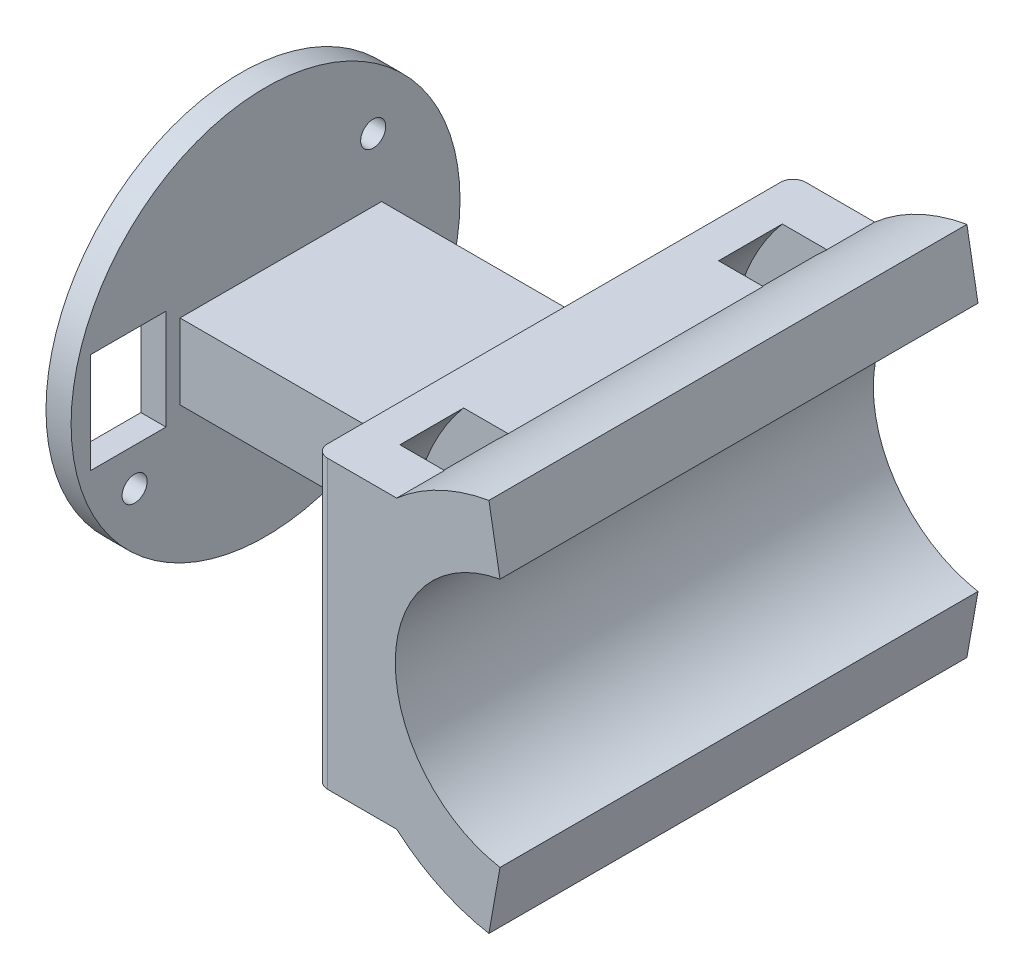
ISO-10303-21;
HEADER;
FILE_DESCRIPTION(('STEP AP214'),'2;1');
FILE_NAME('part.step','',(''),(''),'','','');
FILE_SCHEMA(('AUTOMOTIVE_DESIGN { 1 0 10303 214 1 1 1 1 }'));
ENDSEC;
DATA;
#1=APPLICATION_CONTEXT('core data for automotive mechanical design processes');
#2=APPLICATION_PROTOCOL_DEFINITION('international standard','automotive_design',2000,#1);
#3=PRODUCT_CONTEXT('',#1,'mechanical');
#4=PRODUCT('Part','Part','',(#3));
#5=PRODUCT_RELATED_PRODUCT_CATEGORY('part','',(#4));
#6=PRODUCT_DEFINITION_FORMATION('','',#4);
#7=PRODUCT_DEFINITION_CONTEXT('part definition',#1,'design');
#8=PRODUCT_DEFINITION('design','',#6,#7);
#9=PRODUCT_DEFINITION_SHAPE('','',#8);
#10=(LENGTH_UNIT() NAMED_UNIT(*) SI_UNIT(.MILLI.,.METRE.));
#11=(NAMED_UNIT(*) PLANE_ANGLE_UNIT() SI_UNIT($,.RADIAN.));
#12=(NAMED_UNIT(*) SI_UNIT($,.STERADIAN.) SOLID_ANGLE_UNIT());
#13=UNCERTAINTY_MEASURE_WITH_UNIT(LENGTH_MEASURE(1.E-05),#10,'distance_accuracy_value','');
#14=(GEOMETRIC_REPRESENTATION_CONTEXT(3) GLOBAL_UNCERTAINTY_ASSIGNED_CONTEXT((#13)) GLOBAL_UNIT_ASSIGNED_CONTEXT((#10,
#11,#12)) REPRESENTATION_CONTEXT('',''));
#15=CARTESIAN_POINT('',(0.,0.,0.));
#16=DIRECTION('',(0.,0.,1.));
#17=DIRECTION('',(1.,0.,0.));
#18=AXIS2_PLACEMENT_3D('',#15,#16,#17);
#19=CARTESIAN_POINT('',(-6.38936934946346,-11.43,19.05));
#20=DIRECTION('',(1.,0.,0.));
#21=DIRECTION('',(0.,1.,0.));
#22=AXIS2_PLACEMENT_3D('',#19,#20,#21);
#23=PLANE('',#22);
#24=DIRECTION('',(0.,0.,1.));
#25=VECTOR('',#24,1.);
#26=CARTESIAN_POINT('',(-6.38936934946345,-6.48838180573363,19.05));
#27=LINE('',#26,#25);
#28=CARTESIAN_POINT('',(-6.38936934946345,-6.48838180573363,-15.24));
#29=VERTEX_POINT('',#28);
#30=CARTESIAN_POINT('',(-6.38936934946346,-6.48838180573361,-10.16));
#31=VERTEX_POINT('',#30);
#32=EDGE_CURVE('E405',#29,#31,#27,.T.);
#33=ORIENTED_EDGE('',*,*,#32,.F.);
#34=DIRECTION('',(0.,1.,0.));
#35=VECTOR('',#34,1.);
#36=CARTESIAN_POINT('',(-6.38936934946346,-11.43,-15.24));
#37=LINE('',#36,#35);
#38=CARTESIAN_POINT('',(-6.38936934946345,6.48838180573364,-15.24));
#39=VERTEX_POINT('',#38);
#40=EDGE_CURVE('E385',#29,#39,#37,.T.);
#41=ORIENTED_EDGE('',*,*,#40,.T.);
#42=DIRECTION('',(0.,0.,1.));
#43=VECTOR('',#42,1.);
#44=CARTESIAN_POINT('',(-6.38936934946345,6.48838180573364,19.05));
#45=LINE('',#44,#43);
#46=CARTESIAN_POINT('',(-6.38936934946346,6.48838180573362,-10.16));
#47=VERTEX_POINT('',#46);
#48=EDGE_CURVE('E409',#47,#39,#45,.F.);
#49=ORIENTED_EDGE('',*,*,#48,.F.);
#50=DIRECTION('',(0.,1.,0.));
#51=VECTOR('',#50,1.);
#52=CARTESIAN_POINT('',(-6.38936934946346,-11.43,-10.16));
#53=LINE('',#52,#51);
#54=EDGE_CURVE('E374',#31,#47,#53,.T.);
#55=ORIENTED_EDGE('',*,*,#54,.F.);
#56=EDGE_LOOP('',(#33,#41,#49,#55));
#57=FACE_BOUND('',#56,.T.);
#58=DIRECTION('',(0.,-1.,0.));
#59=VECTOR('',#58,1.);
#60=CARTESIAN_POINT('',(-6.38936934946346,-3.,-9.2493893907033));
#61=LINE('',#60,#59);
#62=CARTESIAN_POINT('',(-6.38936934946346,3.,-9.2493893907033));
#63=VERTEX_POINT('',#62);
#64=CARTESIAN_POINT('',(-6.38936934946346,-3.,-9.2493893907033));
#65=VERTEX_POINT('',#64);
#66=EDGE_CURVE('E412',#63,#65,#61,.T.);
#67=ORIENTED_EDGE('',*,*,#66,.F.);
#68=DIRECTION('',(0.,0.,-1.));
#69=VECTOR('',#68,1.);
#70=CARTESIAN_POINT('',(-6.38936934946346,3.,-9.2493893907033));
#71=LINE('',#70,#69);
#72=CARTESIAN_POINT('',(-6.38936934946346,3.,6.82201027291285));
#73=VERTEX_POINT('',#72);
#74=EDGE_CURVE('E418',#73,#63,#71,.T.);
#75=ORIENTED_EDGE('',*,*,#74,.F.);
#76=DIRECTION('',(0.,1.,0.));
#77=VECTOR('',#76,1.);
#78=CARTESIAN_POINT('',(-6.38936934946346,-3.,6.82201027291285));
#79=LINE('',#78,#77);
#80=CARTESIAN_POINT('',(-6.38936934946346,-3.,6.82201027291285));
#81=VERTEX_POINT('',#80);
#82=EDGE_CURVE('E438',#81,#73,#79,.T.);
#83=ORIENTED_EDGE('',*,*,#82,.F.);
#84=DIRECTION('',(0.,0.,1.));
#85=VECTOR('',#84,1.);
#86=CARTESIAN_POINT('',(-6.38936934946346,-3.,-9.2493893907033));
#87=LINE('',#86,#85);
#88=EDGE_CURVE('E434',#65,#81,#87,.T.);
#89=ORIENTED_EDGE('',*,*,#88,.F.);
#90=EDGE_LOOP('',(#67,#75,#83,#89));
#91=FACE_BOUND('',#90,.T.);
#92=DIRECTION('',(0.,0.,-1.));
#93=VECTOR('',#92,1.);
#94=CARTESIAN_POINT('',(-6.38936934946346,11.43,19.05));
#95=LINE('',#94,#93);
#96=CARTESIAN_POINT('',(-6.38936934946346,11.43,18.05));
#97=VERTEX_POINT('',#96);
#98=CARTESIAN_POINT('',(-6.38936934946346,11.43,-18.05));
#99=VERTEX_POINT('',#98);
#100=EDGE_CURVE('E524',#97,#99,#95,.T.);
#101=ORIENTED_EDGE('',*,*,#100,.T.);
#102=DIRECTION('',(0.,-1.,0.));
#103=VECTOR('',#102,1.);
#104=CARTESIAN_POINT('',(-6.38936934946346,-11.43,-18.05));
#105=LINE('',#104,#103);
#106=CARTESIAN_POINT('',(-6.38936934946346,-11.43,-18.05));
#107=VERTEX_POINT('',#106);
#108=EDGE_CURVE('E551',#99,#107,#105,.T.);
#109=ORIENTED_EDGE('',*,*,#108,.T.);
#110=DIRECTION('',(0.,0.,-1.));
#111=VECTOR('',#110,1.);
#112=CARTESIAN_POINT('',(-6.38936934946346,-11.43,19.05));
#113=LINE('',#112,#111);
#114=CARTESIAN_POINT('',(-6.38936934946346,-11.43,18.05));
#115=VERTEX_POINT('',#114);
#116=EDGE_CURVE('E519',#115,#107,#113,.T.);
#117=ORIENTED_EDGE('',*,*,#116,.F.);
#118=DIRECTION('',(0.,-1.,0.));
#119=VECTOR('',#118,1.);
#120=CARTESIAN_POINT('',(-6.38936934946346,-11.43,18.05));
#121=LINE('',#120,#119);
#122=EDGE_CURVE('E548',#115,#97,#121,.F.);
#123=ORIENTED_EDGE('',*,*,#122,.T.);
#124=EDGE_LOOP('',(#101,#109,#117,#123));
#125=FACE_BOUND('',#124,.T.);
#126=DIRECTION('',(0.,1.,0.));
#127=VECTOR('',#126,1.);
#128=CARTESIAN_POINT('',(-6.38936934946346,-11.43,15.24));
#129=LINE('',#128,#127);
#130=CARTESIAN_POINT('',(-6.38936934946346,-6.48838180573362,15.24));
#131=VERTEX_POINT('',#130);
#132=CARTESIAN_POINT('',(-6.38936934946346,6.48838180573363,15.24));
#133=VERTEX_POINT('',#132);
#134=EDGE_CURVE('E365',#131,#133,#129,.T.);
#135=ORIENTED_EDGE('',*,*,#134,.F.);
#136=DIRECTION('',(0.,0.,1.));
#137=VECTOR('',#136,1.);
#138=CARTESIAN_POINT('',(-6.38936934946345,-6.48838180573364,19.05));
#139=LINE('',#138,#137);
#140=CARTESIAN_POINT('',(-6.38936934946346,-6.48838180573362,10.16));
#141=VERTEX_POINT('',#140);
#142=EDGE_CURVE('E393',#131,#141,#139,.F.);
#143=ORIENTED_EDGE('',*,*,#142,.T.);
#144=DIRECTION('',(0.,1.,0.));
#145=VECTOR('',#144,1.);
#146=CARTESIAN_POINT('',(-6.38936934946346,-11.43,10.16));
#147=LINE('',#146,#145);
#148=CARTESIAN_POINT('',(-6.38936934946346,6.48838180573363,10.16));
#149=VERTEX_POINT('',#148);
#150=EDGE_CURVE('E355',#141,#149,#147,.T.);
#151=ORIENTED_EDGE('',*,*,#150,.T.);
#152=DIRECTION('',(0.,0.,1.));
#153=VECTOR('',#152,1.);
#154=CARTESIAN_POINT('',(-6.38936934946345,6.48838180573365,19.05));
#155=LINE('',#154,#153);
#156=EDGE_CURVE('E397',#149,#133,#155,.T.);
#157=ORIENTED_EDGE('',*,*,#156,.T.);
#158=EDGE_LOOP('',(#135,#143,#151,#157));
#159=FACE_BOUND('',#158,.T.);
#160=ADVANCED_FACE('F47',(#57,#91,#125,#159),#23,.F.);
#161=CARTESIAN_POINT('',(0.110630650536534,11.43,19.05));
#162=DIRECTION('',(0.,-1.,0.));
#163=DIRECTION('',(1.,0.,0.));
#164=AXIS2_PLACEMENT_3D('',#161,#162,#163);
#165=PLANE('',#164);
#166=DIRECTION('',(-1.,0.,0.));
#167=VECTOR('',#166,1.);
#168=CARTESIAN_POINT('',(0.110630650536534,11.43,-19.05));
#169=LINE('',#168,#167);
#170=CARTESIAN_POINT('',(0.110630650536534,11.43,-19.05));
#171=VERTEX_POINT('',#170);
#172=CARTESIAN_POINT('',(-5.38936934946346,11.43,-19.05));
#173=VERTEX_POINT('',#172);
#174=EDGE_CURVE('E496',#171,#173,#169,.T.);
#175=ORIENTED_EDGE('',*,*,#174,.T.);
#176=CARTESIAN_POINT('',(-5.38936934946346,11.43,-18.05));
#177=DIRECTION('',(0.,-1.,0.));
#178=DIRECTION('',(1.,0.,0.));
#179=AXIS2_PLACEMENT_3D('',#176,#177,#178);
#180=CIRCLE('',#179,1.);
#181=EDGE_CURVE('E56',#173,#99,#180,.F.);
#182=ORIENTED_EDGE('',*,*,#181,.T.);
#183=ORIENTED_EDGE('',*,*,#100,.F.);
#184=CARTESIAN_POINT('',(-5.38936934946346,11.43,18.05));
#185=DIRECTION('',(0.,-1.,0.));
#186=DIRECTION('',(1.,0.,0.));
#187=AXIS2_PLACEMENT_3D('',#184,#185,#186);
#188=CIRCLE('',#187,1.);
#189=CARTESIAN_POINT('',(-5.38936934946346,11.43,19.05));
#190=VERTEX_POINT('',#189);
#191=EDGE_CURVE('E63',#97,#190,#188,.F.);
#192=ORIENTED_EDGE('',*,*,#191,.T.);
#193=DIRECTION('',(-1.,0.,0.));
#194=VECTOR('',#193,1.);
#195=CARTESIAN_POINT('',(0.110630650536534,11.43,19.05));
#196=LINE('',#195,#194);
#197=CARTESIAN_POINT('',(0.110630650536534,11.43,19.05));
#198=VERTEX_POINT('',#197);
#199=EDGE_CURVE('E472',#198,#190,#196,.T.);
#200=ORIENTED_EDGE('',*,*,#199,.F.);
#201=DIRECTION('',(0.,0.,-1.));
#202=VECTOR('',#201,1.);
#203=CARTESIAN_POINT('',(0.110630650536534,11.43,19.05));
#204=LINE('',#203,#202);
#205=CARTESIAN_POINT('',(0.110630650536528,11.43,15.24));
#206=VERTEX_POINT('',#205);
#207=EDGE_CURVE('E529',#198,#206,#204,.T.);
#208=ORIENTED_EDGE('',*,*,#207,.T.);
#209=DIRECTION('',(1.,0.,0.));
#210=VECTOR('',#209,1.);
#211=CARTESIAN_POINT('',(0.110630650536534,11.43,15.24));
#212=LINE('',#211,#210);
#213=CARTESIAN_POINT('',(-3.44080869076881,11.43,15.24));
#214=VERTEX_POINT('',#213);
#215=EDGE_CURVE('E362',#214,#206,#212,.T.);
#216=ORIENTED_EDGE('',*,*,#215,.F.);
#217=DIRECTION('',(0.,0.,1.));
#218=VECTOR('',#217,1.);
#219=CARTESIAN_POINT('',(-3.44080869076881,11.43,19.05));
#220=LINE('',#219,#218);
#221=CARTESIAN_POINT('',(-3.44080869076881,11.43,10.16));
#222=VERTEX_POINT('',#221);
#223=EDGE_CURVE('E389',#214,#222,#220,.F.);
#224=ORIENTED_EDGE('',*,*,#223,.T.);
#225=DIRECTION('',(1.,0.,0.));
#226=VECTOR('',#225,1.);
#227=CARTESIAN_POINT('',(0.110630650536534,11.43,10.16));
#228=LINE('',#227,#226);
#229=CARTESIAN_POINT('',(0.110630650536534,11.43,10.16));
#230=VERTEX_POINT('',#229);
#231=EDGE_CURVE('E351',#222,#230,#228,.T.);
#232=ORIENTED_EDGE('',*,*,#231,.T.);
#233=CARTESIAN_POINT('',(0.110630650536537,11.43,-10.16));
#234=VERTEX_POINT('',#233);
#235=EDGE_CURVE('E534',#230,#234,#204,.T.);
#236=ORIENTED_EDGE('',*,*,#235,.T.);
#237=DIRECTION('',(1.,0.,0.));
#238=VECTOR('',#237,1.);
#239=CARTESIAN_POINT('',(0.110630650536534,11.43,-10.16));
#240=LINE('',#239,#238);
#241=CARTESIAN_POINT('',(-3.44080869076881,11.43,-10.16));
#242=VERTEX_POINT('',#241);
#243=EDGE_CURVE('E371',#242,#234,#240,.T.);
#244=ORIENTED_EDGE('',*,*,#243,.F.);
#245=DIRECTION('',(0.,0.,1.));
#246=VECTOR('',#245,1.);
#247=CARTESIAN_POINT('',(-3.44080869076881,11.43,19.05));
#248=LINE('',#247,#246);
#249=CARTESIAN_POINT('',(-3.44080869076881,11.43,-15.24));
#250=VERTEX_POINT('',#249);
#251=EDGE_CURVE('E401',#250,#242,#248,.T.);
#252=ORIENTED_EDGE('',*,*,#251,.F.);
#253=DIRECTION('',(1.,0.,0.));
#254=VECTOR('',#253,1.);
#255=CARTESIAN_POINT('',(0.110630650536534,11.43,-15.24));
#256=LINE('',#255,#254);
#257=CARTESIAN_POINT('',(0.110630650536533,11.43,-15.24));
#258=VERTEX_POINT('',#257);
#259=EDGE_CURVE('E381',#250,#258,#256,.T.);
#260=ORIENTED_EDGE('',*,*,#259,.T.);
#261=EDGE_CURVE('E528',#258,#171,#204,.T.);
#262=ORIENTED_EDGE('',*,*,#261,.T.);
#263=EDGE_LOOP('',(#175,#182,#183,#192,#200,#208,#216,#224,#232,#236,#244,#252,#260,#262));
#264=FACE_BOUND('',#263,.T.);
#265=ADVANCED_FACE('F566',(#264),#165,.F.);
#266=CARTESIAN_POINT('',(0.110630650536537,-11.43,19.05));
#267=DIRECTION('',(0.,1.,0.));
#268=DIRECTION('',(-1.,0.,0.));
#269=AXIS2_PLACEMENT_3D('',#266,#267,#268);
#270=PLANE('',#269);
#271=ORIENTED_EDGE('',*,*,#116,.T.);
#272=CARTESIAN_POINT('',(-5.38936934946346,-11.43,-18.05));
#273=DIRECTION('',(0.,1.,0.));
#274=DIRECTION('',(-1.,0.,0.));
#275=AXIS2_PLACEMENT_3D('',#272,#273,#274);
#276=CIRCLE('',#275,1.);
#277=CARTESIAN_POINT('',(-5.38936934946346,-11.43,-19.05));
#278=VERTEX_POINT('',#277);
#279=EDGE_CURVE('E558',#107,#278,#276,.F.);
#280=ORIENTED_EDGE('',*,*,#279,.T.);
#281=DIRECTION('',(1.,0.,0.));
#282=VECTOR('',#281,1.);
#283=CARTESIAN_POINT('',(0.110630650536537,-11.43,-19.05));
#284=LINE('',#283,#282);
#285=CARTESIAN_POINT('',(0.11063065053654,-11.43,-19.05));
#286=VERTEX_POINT('',#285);
#287=EDGE_CURVE('E499',#278,#286,#284,.T.);
#288=ORIENTED_EDGE('',*,*,#287,.T.);
#289=DIRECTION('',(0.,0.,-1.));
#290=VECTOR('',#289,1.);
#291=CARTESIAN_POINT('',(0.11063065053654,-11.43,19.05));
#292=LINE('',#291,#290);
#293=CARTESIAN_POINT('',(0.110630650536542,-11.43,-15.24));
#294=VERTEX_POINT('',#293);
#295=EDGE_CURVE('E514',#294,#286,#292,.T.);
#296=ORIENTED_EDGE('',*,*,#295,.F.);
#297=DIRECTION('',(-1.,0.,0.));
#298=VECTOR('',#297,1.);
#299=CARTESIAN_POINT('',(0.110630650536537,-11.43,-15.24));
#300=LINE('',#299,#298);
#301=CARTESIAN_POINT('',(-3.4408086907688,-11.43,-15.24));
#302=VERTEX_POINT('',#301);
#303=EDGE_CURVE('E377',#294,#302,#300,.T.);
#304=ORIENTED_EDGE('',*,*,#303,.T.);
#305=DIRECTION('',(0.,0.,1.));
#306=VECTOR('',#305,1.);
#307=CARTESIAN_POINT('',(-3.4408086907688,-11.43,19.05));
#308=LINE('',#307,#306);
#309=CARTESIAN_POINT('',(-3.4408086907688,-11.43,-10.16));
#310=VERTEX_POINT('',#309);
#311=EDGE_CURVE('E545',#310,#302,#308,.F.);
#312=ORIENTED_EDGE('',*,*,#311,.F.);
#313=DIRECTION('',(-1.,0.,0.));
#314=VECTOR('',#313,1.);
#315=CARTESIAN_POINT('',(0.110630650536537,-11.43,-10.16));
#316=LINE('',#315,#314);
#317=CARTESIAN_POINT('',(0.11063065053654,-11.43,-10.16));
#318=VERTEX_POINT('',#317);
#319=EDGE_CURVE('E368',#318,#310,#316,.T.);
#320=ORIENTED_EDGE('',*,*,#319,.F.);
#321=CARTESIAN_POINT('',(0.11063065053654,-11.43,10.16));
#322=VERTEX_POINT('',#321);
#323=EDGE_CURVE('E520',#322,#318,#292,.T.);
#324=ORIENTED_EDGE('',*,*,#323,.F.);
#325=DIRECTION('',(-1.,0.,0.));
#326=VECTOR('',#325,1.);
#327=CARTESIAN_POINT('',(0.110630650536537,-11.43,10.16));
#328=LINE('',#327,#326);
#329=CARTESIAN_POINT('',(-3.44080869076881,-11.43,10.16));
#330=VERTEX_POINT('',#329);
#331=EDGE_CURVE('E333',#322,#330,#328,.T.);
#332=ORIENTED_EDGE('',*,*,#331,.T.);
#333=DIRECTION('',(0.,0.,1.));
#334=VECTOR('',#333,1.);
#335=CARTESIAN_POINT('',(-3.44080869076881,-11.43,19.05));
#336=LINE('',#335,#334);
#337=CARTESIAN_POINT('',(-3.44080869076881,-11.43,15.24));
#338=VERTEX_POINT('',#337);
#339=EDGE_CURVE('E541',#330,#338,#336,.T.);
#340=ORIENTED_EDGE('',*,*,#339,.T.);
#341=DIRECTION('',(-1.,0.,0.));
#342=VECTOR('',#341,1.);
#343=CARTESIAN_POINT('',(0.110630650536537,-11.43,15.24));
#344=LINE('',#343,#342);
#345=CARTESIAN_POINT('',(0.11063065053654,-11.43,15.24));
#346=VERTEX_POINT('',#345);
#347=EDGE_CURVE('E359',#346,#338,#344,.T.);
#348=ORIENTED_EDGE('',*,*,#347,.F.);
#349=CARTESIAN_POINT('',(0.11063065053654,-11.43,19.05));
#350=VERTEX_POINT('',#349);
#351=EDGE_CURVE('E515',#350,#346,#292,.T.);
#352=ORIENTED_EDGE('',*,*,#351,.F.);
#353=DIRECTION('',(1.,0.,0.));
#354=VECTOR('',#353,1.);
#355=CARTESIAN_POINT('',(0.110630650536537,-11.43,19.05));
#356=LINE('',#355,#354);
#357=CARTESIAN_POINT('',(-5.38936934946346,-11.43,19.05));
#358=VERTEX_POINT('',#357);
#359=EDGE_CURVE('E475',#358,#350,#356,.T.);
#360=ORIENTED_EDGE('',*,*,#359,.F.);
#361=CARTESIAN_POINT('',(-5.38936934946346,-11.43,18.05));
#362=DIRECTION('',(0.,1.,0.));
#363=DIRECTION('',(-1.,0.,0.));
#364=AXIS2_PLACEMENT_3D('',#361,#362,#363);
#365=CIRCLE('',#364,1.);
#366=EDGE_CURVE('E555',#358,#115,#365,.F.);
#367=ORIENTED_EDGE('',*,*,#366,.T.);
#368=EDGE_LOOP('',(#271,#280,#288,#296,#304,#312,#320,#324,#332,#340,#348,#352,#360,#367));
#369=FACE_BOUND('',#368,.T.);
#370=ADVANCED_FACE('F575',(#369),#270,.F.);
#371=CARTESIAN_POINT('',(10.1,0.,19.05));
#372=DIRECTION('',(0.,0.,-1.));
#373=DIRECTION('',(-1.,0.,0.));
#374=AXIS2_PLACEMENT_3D('',#371,#372,#373);
#375=CYLINDRICAL_SURFACE('',#374,10.1);
#376=CARTESIAN_POINT('',(10.1,0.,-19.05));
#377=DIRECTION('',(0.,0.,-1.));
#378=DIRECTION('',(-1.,0.,0.));
#379=AXIS2_PLACEMENT_3D('',#376,#377,#378);
#380=CIRCLE('',#379,10.1);
#381=CARTESIAN_POINT('',(8.34615340556399,-9.9465583054233,-19.05));
#382=VERTEX_POINT('',#381);
#383=CARTESIAN_POINT('',(8.34615340556399,9.9465583054233,-19.05));
#384=VERTEX_POINT('',#383);
#385=EDGE_CURVE('E460',#382,#384,#380,.T.);
#386=ORIENTED_EDGE('',*,*,#385,.T.);
#387=DIRECTION('',(0.,0.,-1.));
#388=VECTOR('',#387,1.);
#389=CARTESIAN_POINT('',(8.34615340556399,9.9465583054233,19.05));
#390=LINE('',#389,#388);
#391=CARTESIAN_POINT('',(8.34615340556399,9.9465583054233,19.05));
#392=VERTEX_POINT('',#391);
#393=EDGE_CURVE('E537',#392,#384,#390,.T.);
#394=ORIENTED_EDGE('',*,*,#393,.F.);
#395=CARTESIAN_POINT('',(10.1,0.,19.05));
#396=DIRECTION('',(0.,0.,-1.));
#397=DIRECTION('',(-1.,0.,0.));
#398=AXIS2_PLACEMENT_3D('',#395,#396,#397);
#399=CIRCLE('',#398,10.1);
#400=CARTESIAN_POINT('',(8.34615340556399,-9.9465583054233,19.05));
#401=VERTEX_POINT('',#400);
#402=EDGE_CURVE('E461',#401,#392,#399,.T.);
#403=ORIENTED_EDGE('',*,*,#402,.F.);
#404=DIRECTION('',(0.,0.,-1.));
#405=VECTOR('',#404,1.);
#406=CARTESIAN_POINT('',(8.34615340556399,-9.9465583054233,19.05));
#407=LINE('',#406,#405);
#408=EDGE_CURVE('E484',#401,#382,#407,.T.);
#409=ORIENTED_EDGE('',*,*,#408,.T.);
#410=EDGE_LOOP('',(#386,#394,#403,#409));
#411=FACE_BOUND('',#410,.T.);
#412=ADVANCED_FACE('F650',(#411),#375,.F.);
#413=CARTESIAN_POINT('',(8.34615340556399,9.9465583054233,19.05));
#414=DIRECTION('',(-0.984807753012208,-0.173648177666931,0.));
#415=DIRECTION('',(0.173648177666931,-0.984807753012208,0.));
#416=AXIS2_PLACEMENT_3D('',#413,#414,#415);
#417=PLANE('',#416);
#418=DIRECTION('',(-0.173648177666931,0.984807753012208,0.));
#419=VECTOR('',#418,1.);
#420=CARTESIAN_POINT('',(8.34615340556399,9.9465583054233,-19.05));
#421=LINE('',#420,#419);
#422=CARTESIAN_POINT('',(7.46402066301598,14.9493816907253,-19.05));
#423=VERTEX_POINT('',#422);
#424=EDGE_CURVE('E488',#384,#423,#421,.T.);
#425=ORIENTED_EDGE('',*,*,#424,.T.);
#426=DIRECTION('',(0.,0.,-1.));
#427=VECTOR('',#426,1.);
#428=CARTESIAN_POINT('',(7.46402066301598,14.9493816907253,19.05));
#429=LINE('',#428,#427);
#430=CARTESIAN_POINT('',(7.46402066301598,14.9493816907253,19.05));
#431=VERTEX_POINT('',#430);
#432=EDGE_CURVE('E533',#431,#423,#429,.T.);
#433=ORIENTED_EDGE('',*,*,#432,.F.);
#434=DIRECTION('',(-0.173648177666931,0.984807753012208,0.));
#435=VECTOR('',#434,1.);
#436=CARTESIAN_POINT('',(8.34615340556399,9.9465583054233,19.05));
#437=LINE('',#436,#435);
#438=EDGE_CURVE('E465',#392,#431,#437,.T.);
#439=ORIENTED_EDGE('',*,*,#438,.F.);
#440=ORIENTED_EDGE('',*,*,#393,.T.);
#441=EDGE_LOOP('',(#425,#433,#439,#440));
#442=FACE_BOUND('',#441,.T.);
#443=ADVANCED_FACE('F647',(#442),#417,.F.);
#444=CARTESIAN_POINT('',(10.1,0.,19.05));
#445=DIRECTION('',(0.,0.,-1.));
#446=DIRECTION('',(-1.,0.,0.));
#447=AXIS2_PLACEMENT_3D('',#444,#445,#446);
#448=CYLINDRICAL_SURFACE('',#447,15.18);
#449=ORIENTED_EDGE('',*,*,#432,.T.);
#450=CARTESIAN_POINT('',(10.1,0.,-19.05));
#451=DIRECTION('',(0.,0.,1.));
#452=DIRECTION('',(-1.,0.,0.));
#453=AXIS2_PLACEMENT_3D('',#450,#451,#452);
#454=CIRCLE('',#453,15.18);
#455=EDGE_CURVE('E492',#423,#171,#454,.T.);
#456=ORIENTED_EDGE('',*,*,#455,.T.);
#457=ORIENTED_EDGE('',*,*,#261,.F.);
#458=CARTESIAN_POINT('',(10.1,0.,-15.24));
#459=DIRECTION('',(0.,0.,1.));
#460=DIRECTION('',(1.,0.,0.));
#461=AXIS2_PLACEMENT_3D('',#458,#459,#460);
#462=CIRCLE('',#461,15.18);
#463=EDGE_CURVE('E329',#258,#294,#462,.T.);
#464=ORIENTED_EDGE('',*,*,#463,.T.);
#465=ORIENTED_EDGE('',*,*,#295,.T.);
#466=CARTESIAN_POINT('',(10.1,0.,-19.05));
#467=DIRECTION('',(0.,0.,1.));
#468=DIRECTION('',(-1.,0.,0.));
#469=AXIS2_PLACEMENT_3D('',#466,#467,#468);
#470=CIRCLE('',#469,15.18);
#471=CARTESIAN_POINT('',(7.46402066301598,-14.9493816907253,-19.05));
#472=VERTEX_POINT('',#471);
#473=EDGE_CURVE('E502',#286,#472,#470,.T.);
#474=ORIENTED_EDGE('',*,*,#473,.T.);
#475=DIRECTION('',(0.,0.,-1.));
#476=VECTOR('',#475,1.);
#477=CARTESIAN_POINT('',(7.46402066301598,-14.9493816907253,19.05));
#478=LINE('',#477,#476);
#479=CARTESIAN_POINT('',(7.46402066301598,-14.9493816907253,19.05));
#480=VERTEX_POINT('',#479);
#481=EDGE_CURVE('E511',#480,#472,#478,.T.);
#482=ORIENTED_EDGE('',*,*,#481,.F.);
#483=CARTESIAN_POINT('',(10.1,0.,19.05));
#484=DIRECTION('',(0.,0.,1.));
#485=DIRECTION('',(-1.,0.,0.));
#486=AXIS2_PLACEMENT_3D('',#483,#484,#485);
#487=CIRCLE('',#486,15.18);
#488=EDGE_CURVE('E478',#350,#480,#487,.T.);
#489=ORIENTED_EDGE('',*,*,#488,.F.);
#490=ORIENTED_EDGE('',*,*,#351,.T.);
#491=CARTESIAN_POINT('',(10.1,0.,15.24));
#492=DIRECTION('',(0.,0.,1.));
#493=DIRECTION('',(1.,0.,0.));
#494=AXIS2_PLACEMENT_3D('',#491,#492,#493);
#495=CIRCLE('',#494,15.18);
#496=EDGE_CURVE('E341',#206,#346,#495,.T.);
#497=ORIENTED_EDGE('',*,*,#496,.F.);
#498=ORIENTED_EDGE('',*,*,#207,.F.);
#499=CARTESIAN_POINT('',(10.1,0.,19.05));
#500=DIRECTION('',(0.,0.,1.));
#501=DIRECTION('',(-1.,0.,0.));
#502=AXIS2_PLACEMENT_3D('',#499,#500,#501);
#503=CIRCLE('',#502,15.18);
#504=EDGE_CURVE('E469',#431,#198,#503,.T.);
#505=ORIENTED_EDGE('',*,*,#504,.F.);
#506=EDGE_LOOP('',(#449,#456,#457,#464,#465,#474,#482,#489,#490,#497,#498,#505));
#507=FACE_BOUND('',#506,.T.);
#508=CARTESIAN_POINT('',(10.1,0.,-10.16));
#509=DIRECTION('',(0.,0.,1.));
#510=DIRECTION('',(1.,0.,0.));
#511=AXIS2_PLACEMENT_3D('',#508,#509,#510);
#512=CIRCLE('',#511,15.18);
#513=EDGE_CURVE('E315',#234,#318,#512,.T.);
#514=ORIENTED_EDGE('',*,*,#513,.F.);
#515=ORIENTED_EDGE('',*,*,#235,.F.);
#516=CARTESIAN_POINT('',(10.1,0.,10.16));
#517=DIRECTION('',(0.,0.,1.));
#518=DIRECTION('',(1.,0.,0.));
#519=AXIS2_PLACEMENT_3D('',#516,#517,#518);
#520=CIRCLE('',#519,15.18);
#521=EDGE_CURVE('E337',#230,#322,#520,.T.);
#522=ORIENTED_EDGE('',*,*,#521,.T.);
#523=ORIENTED_EDGE('',*,*,#323,.T.);
#524=EDGE_LOOP('',(#514,#515,#522,#523));
#525=FACE_BOUND('',#524,.T.);
#526=ADVANCED_FACE('F584',(#507,#525),#448,.T.);
#527=CARTESIAN_POINT('',(8.34615340556399,-9.9465583054233,19.05));
#528=DIRECTION('',(-0.984807753012208,0.173648177666931,0.));
#529=DIRECTION('',(-0.173648177666931,-0.984807753012208,0.));
#530=AXIS2_PLACEMENT_3D('',#527,#528,#529);
#531=PLANE('',#530);
#532=DIRECTION('',(0.173648177666931,0.984807753012208,0.));
#533=VECTOR('',#532,1.);
#534=CARTESIAN_POINT('',(8.34615340556399,-9.9465583054233,-19.05));
#535=LINE('',#534,#533);
#536=EDGE_CURVE('E466',#472,#382,#535,.T.);
#537=ORIENTED_EDGE('',*,*,#536,.T.);
#538=ORIENTED_EDGE('',*,*,#408,.F.);
#539=DIRECTION('',(0.173648177666931,0.984807753012208,0.));
#540=VECTOR('',#539,1.);
#541=CARTESIAN_POINT('',(8.34615340556399,-9.9465583054233,19.05));
#542=LINE('',#541,#540);
#543=EDGE_CURVE('E481',#480,#401,#542,.T.);
#544=ORIENTED_EDGE('',*,*,#543,.F.);
#545=ORIENTED_EDGE('',*,*,#481,.T.);
#546=EDGE_LOOP('',(#537,#538,#544,#545));
#547=FACE_BOUND('',#546,.T.);
#548=ADVANCED_FACE('F714',(#547),#531,.F.);
#549=CARTESIAN_POINT('',(10.1,0.,19.05));
#550=DIRECTION('',(0.,0.,-1.));
#551=DIRECTION('',(-1.,0.,0.));
#552=AXIS2_PLACEMENT_3D('',#549,#550,#551);
#553=PLANE('',#552);
#554=ORIENTED_EDGE('',*,*,#199,.T.);
#555=DIRECTION('',(0.,-1.,0.));
#556=VECTOR('',#555,1.);
#557=CARTESIAN_POINT('',(-5.38936934946346,0.,19.05));
#558=LINE('',#557,#556);
#559=EDGE_CURVE('E11',#190,#358,#558,.T.);
#560=ORIENTED_EDGE('',*,*,#559,.T.);
#561=ORIENTED_EDGE('',*,*,#359,.T.);
#562=ORIENTED_EDGE('',*,*,#488,.T.);
#563=ORIENTED_EDGE('',*,*,#543,.T.);
#564=ORIENTED_EDGE('',*,*,#402,.T.);
#565=ORIENTED_EDGE('',*,*,#438,.T.);
#566=ORIENTED_EDGE('',*,*,#504,.T.);
#567=EDGE_LOOP('',(#554,#560,#561,#562,#563,#564,#565,#566));
#568=FACE_BOUND('',#567,.T.);
#569=ADVANCED_FACE('F626',(#568),#553,.F.);
#570=CARTESIAN_POINT('',(10.1,0.,-19.05));
#571=DIRECTION('',(0.,0.,-1.));
#572=DIRECTION('',(-1.,0.,0.));
#573=AXIS2_PLACEMENT_3D('',#570,#571,#572);
#574=PLANE('',#573);
#575=ORIENTED_EDGE('',*,*,#287,.F.);
#576=DIRECTION('',(0.,-1.,0.));
#577=VECTOR('',#576,1.);
#578=CARTESIAN_POINT('',(-5.38936934946346,11.43,-19.05));
#579=LINE('',#578,#577);
#580=EDGE_CURVE('E71',#278,#173,#579,.F.);
#581=ORIENTED_EDGE('',*,*,#580,.T.);
#582=ORIENTED_EDGE('',*,*,#174,.F.);
#583=ORIENTED_EDGE('',*,*,#455,.F.);
#584=ORIENTED_EDGE('',*,*,#424,.F.);
#585=ORIENTED_EDGE('',*,*,#385,.F.);
#586=ORIENTED_EDGE('',*,*,#536,.F.);
#587=ORIENTED_EDGE('',*,*,#473,.F.);
#588=EDGE_LOOP('',(#575,#581,#582,#583,#584,#585,#586,#587));
#589=FACE_BOUND('',#588,.T.);
#590=ADVANCED_FACE('F579',(#589),#574,.T.);
#591=CARTESIAN_POINT('',(-29.3893693494635,-3.,-9.2493893907033));
#592=DIRECTION('',(0.,0.,1.));
#593=DIRECTION('',(1.,0.,0.));
#594=AXIS2_PLACEMENT_3D('',#591,#592,#593);
#595=PLANE('',#594);
#596=ORIENTED_EDGE('',*,*,#66,.T.);
#597=DIRECTION('',(1.,0.,0.));
#598=VECTOR('',#597,1.);
#599=CARTESIAN_POINT('',(-29.3893693494635,-3.,-9.2493893907033));
#600=LINE('',#599,#598);
#601=CARTESIAN_POINT('',(-29.3893693494635,-3.,-9.2493893907033));
#602=VERTEX_POINT('',#601);
#603=EDGE_CURVE('E456',#602,#65,#600,.T.);
#604=ORIENTED_EDGE('',*,*,#603,.F.);
#605=DIRECTION('',(0.,-1.,0.));
#606=VECTOR('',#605,1.);
#607=CARTESIAN_POINT('',(-29.3893693494635,-3.,-9.2493893907033));
#608=LINE('',#607,#606);
#609=CARTESIAN_POINT('',(-29.3893693494635,3.,-9.2493893907033));
#610=VERTEX_POINT('',#609);
#611=EDGE_CURVE('E413',#610,#602,#608,.T.);
#612=ORIENTED_EDGE('',*,*,#611,.F.);
#613=DIRECTION('',(1.,0.,0.));
#614=VECTOR('',#613,1.);
#615=CARTESIAN_POINT('',(-29.3893693494635,3.,-9.2493893907033));
#616=LINE('',#615,#614);
#617=EDGE_CURVE('E430',#610,#63,#616,.T.);
#618=ORIENTED_EDGE('',*,*,#617,.T.);
#619=EDGE_LOOP('',(#596,#604,#612,#618));
#620=FACE_BOUND('',#619,.T.);
#621=ADVANCED_FACE('F707',(#620),#595,.F.);
#622=CARTESIAN_POINT('',(-29.3893693494635,-3.,-9.2493893907033));
#623=DIRECTION('',(0.,1.,0.));
#624=DIRECTION('',(0.,0.,1.));
#625=AXIS2_PLACEMENT_3D('',#622,#623,#624);
#626=PLANE('',#625);
#627=ORIENTED_EDGE('',*,*,#88,.T.);
#628=DIRECTION('',(1.,0.,0.));
#629=VECTOR('',#628,1.);
#630=CARTESIAN_POINT('',(-29.3893693494635,-3.,6.82201027291285));
#631=LINE('',#630,#629);
#632=CARTESIAN_POINT('',(-29.3893693494635,-3.,6.82201027291285));
#633=VERTEX_POINT('',#632);
#634=EDGE_CURVE('E452',#633,#81,#631,.T.);
#635=ORIENTED_EDGE('',*,*,#634,.F.);
#636=DIRECTION('',(0.,0.,1.));
#637=VECTOR('',#636,1.);
#638=CARTESIAN_POINT('',(-29.3893693494635,-3.,-9.2493893907033));
#639=LINE('',#638,#637);
#640=EDGE_CURVE('E417',#602,#633,#639,.T.);
#641=ORIENTED_EDGE('',*,*,#640,.F.);
#642=ORIENTED_EDGE('',*,*,#603,.T.);
#643=EDGE_LOOP('',(#627,#635,#641,#642));
#644=FACE_BOUND('',#643,.T.);
#645=ADVANCED_FACE('F703',(#644),#626,.F.);
#646=CARTESIAN_POINT('',(-29.3893693494635,-3.,6.82201027291285));
#647=DIRECTION('',(0.,0.,-1.));
#648=DIRECTION('',(-1.,0.,0.));
#649=AXIS2_PLACEMENT_3D('',#646,#647,#648);
#650=PLANE('',#649);
#651=ORIENTED_EDGE('',*,*,#82,.T.);
#652=DIRECTION('',(1.,0.,0.));
#653=VECTOR('',#652,1.);
#654=CARTESIAN_POINT('',(-29.3893693494635,3.,6.82201027291285));
#655=LINE('',#654,#653);
#656=CARTESIAN_POINT('',(-29.3893693494635,3.,6.82201027291285));
#657=VERTEX_POINT('',#656);
#658=EDGE_CURVE('E448',#657,#73,#655,.T.);
#659=ORIENTED_EDGE('',*,*,#658,.F.);
#660=DIRECTION('',(0.,1.,0.));
#661=VECTOR('',#660,1.);
#662=CARTESIAN_POINT('',(-29.3893693494635,-3.,6.82201027291285));
#663=LINE('',#662,#661);
#664=EDGE_CURVE('E422',#633,#657,#663,.T.);
#665=ORIENTED_EDGE('',*,*,#664,.F.);
#666=ORIENTED_EDGE('',*,*,#634,.T.);
#667=EDGE_LOOP('',(#651,#659,#665,#666));
#668=FACE_BOUND('',#667,.T.);
#669=ADVANCED_FACE('F699',(#668),#650,.F.);
#670=CARTESIAN_POINT('',(-29.3893693494635,3.,-9.2493893907033));
#671=DIRECTION('',(0.,-1.,0.));
#672=DIRECTION('',(0.,0.,-1.));
#673=AXIS2_PLACEMENT_3D('',#670,#671,#672);
#674=PLANE('',#673);
#675=ORIENTED_EDGE('',*,*,#74,.T.);
#676=ORIENTED_EDGE('',*,*,#617,.F.);
#677=DIRECTION('',(0.,0.,-1.));
#678=VECTOR('',#677,1.);
#679=CARTESIAN_POINT('',(-29.3893693494635,3.,-9.2493893907033));
#680=LINE('',#679,#678);
#681=EDGE_CURVE('E426',#657,#610,#680,.T.);
#682=ORIENTED_EDGE('',*,*,#681,.F.);
#683=ORIENTED_EDGE('',*,*,#658,.T.);
#684=EDGE_LOOP('',(#675,#676,#682,#683));
#685=FACE_BOUND('',#684,.T.);
#686=ADVANCED_FACE('F696',(#685),#674,.F.);
#687=CARTESIAN_POINT('',(10.1,0.,19.05));
#688=DIRECTION('',(0.,0.,1.));
#689=DIRECTION('',(1.,0.,0.));
#690=AXIS2_PLACEMENT_3D('',#687,#688,#689);
#691=CYLINDRICAL_SURFACE('',#690,17.72);
#692=CARTESIAN_POINT('',(10.1,0.,10.16));
#693=DIRECTION('',(0.,0.,1.));
#694=DIRECTION('',(1.,0.,0.));
#695=AXIS2_PLACEMENT_3D('',#692,#693,#694);
#696=CIRCLE('',#695,17.72);
#697=EDGE_CURVE('E334',#222,#149,#696,.T.);
#698=ORIENTED_EDGE('',*,*,#697,.F.);
#699=ORIENTED_EDGE('',*,*,#223,.F.);
#700=CARTESIAN_POINT('',(10.1,0.,15.24));
#701=DIRECTION('',(0.,0.,1.));
#702=DIRECTION('',(1.,0.,0.));
#703=AXIS2_PLACEMENT_3D('',#700,#701,#702);
#704=CIRCLE('',#703,17.72);
#705=EDGE_CURVE('E319',#214,#133,#704,.T.);
#706=ORIENTED_EDGE('',*,*,#705,.T.);
#707=ORIENTED_EDGE('',*,*,#156,.F.);
#708=EDGE_LOOP('',(#698,#699,#706,#707));
#709=FACE_BOUND('',#708,.T.);
#710=ADVANCED_FACE('F669',(#709),#691,.F.);
#711=EDGE_CURVE('E344',#131,#338,#704,.T.);
#712=ORIENTED_EDGE('',*,*,#711,.T.);
#713=ORIENTED_EDGE('',*,*,#339,.F.);
#714=EDGE_CURVE('E311',#141,#330,#696,.T.);
#715=ORIENTED_EDGE('',*,*,#714,.F.);
#716=ORIENTED_EDGE('',*,*,#142,.F.);
#717=EDGE_LOOP('',(#712,#713,#715,#716));
#718=FACE_BOUND('',#717,.T.);
#719=ADVANCED_FACE('F617',(#718),#691,.F.);
#720=CARTESIAN_POINT('',(0.,0.,15.24));
#721=DIRECTION('',(0.,0.,-1.));
#722=DIRECTION('',(-1.,0.,0.));
#723=AXIS2_PLACEMENT_3D('',#720,#721,#722);
#724=PLANE('',#723);
#725=ORIENTED_EDGE('',*,*,#134,.T.);
#726=ORIENTED_EDGE('',*,*,#705,.F.);
#727=ORIENTED_EDGE('',*,*,#215,.T.);
#728=ORIENTED_EDGE('',*,*,#496,.T.);
#729=ORIENTED_EDGE('',*,*,#347,.T.);
#730=ORIENTED_EDGE('',*,*,#711,.F.);
#731=EDGE_LOOP('',(#725,#726,#727,#728,#729,#730));
#732=FACE_BOUND('',#731,.T.);
#733=ADVANCED_FACE('F664',(#732),#724,.T.);
#734=CARTESIAN_POINT('',(0.,0.,10.16));
#735=DIRECTION('',(0.,0.,-1.));
#736=DIRECTION('',(-1.,0.,0.));
#737=AXIS2_PLACEMENT_3D('',#734,#735,#736);
#738=PLANE('',#737);
#739=ORIENTED_EDGE('',*,*,#714,.T.);
#740=ORIENTED_EDGE('',*,*,#331,.F.);
#741=ORIENTED_EDGE('',*,*,#521,.F.);
#742=ORIENTED_EDGE('',*,*,#231,.F.);
#743=ORIENTED_EDGE('',*,*,#697,.T.);
#744=ORIENTED_EDGE('',*,*,#150,.F.);
#745=EDGE_LOOP('',(#739,#740,#741,#742,#743,#744));
#746=FACE_BOUND('',#745,.T.);
#747=ADVANCED_FACE('F615',(#746),#738,.F.);
#748=CARTESIAN_POINT('',(10.1,0.,19.05));
#749=DIRECTION('',(0.,0.,1.));
#750=DIRECTION('',(1.,0.,0.));
#751=AXIS2_PLACEMENT_3D('',#748,#749,#750);
#752=CYLINDRICAL_SURFACE('',#751,17.72);
#753=ORIENTED_EDGE('',*,*,#48,.T.);
#754=CARTESIAN_POINT('',(10.1,0.,-15.24));
#755=DIRECTION('',(0.,0.,1.));
#756=DIRECTION('',(1.,0.,0.));
#757=AXIS2_PLACEMENT_3D('',#754,#755,#756);
#758=CIRCLE('',#757,17.72);
#759=EDGE_CURVE('E325',#250,#39,#758,.T.);
#760=ORIENTED_EDGE('',*,*,#759,.F.);
#761=ORIENTED_EDGE('',*,*,#251,.T.);
#762=CARTESIAN_POINT('',(10.1,0.,-10.16));
#763=DIRECTION('',(0.,0.,1.));
#764=DIRECTION('',(1.,0.,0.));
#765=AXIS2_PLACEMENT_3D('',#762,#763,#764);
#766=CIRCLE('',#765,17.72);
#767=EDGE_CURVE('E320',#242,#47,#766,.T.);
#768=ORIENTED_EDGE('',*,*,#767,.T.);
#769=EDGE_LOOP('',(#753,#760,#761,#768));
#770=FACE_BOUND('',#769,.T.);
#771=ADVANCED_FACE('F678',(#770),#752,.F.);
#772=ORIENTED_EDGE('',*,*,#32,.T.);
#773=EDGE_CURVE('E318',#31,#310,#766,.T.);
#774=ORIENTED_EDGE('',*,*,#773,.T.);
#775=ORIENTED_EDGE('',*,*,#311,.T.);
#776=EDGE_CURVE('E324',#29,#302,#758,.T.);
#777=ORIENTED_EDGE('',*,*,#776,.F.);
#778=EDGE_LOOP('',(#772,#774,#775,#777));
#779=FACE_BOUND('',#778,.T.);
#780=ADVANCED_FACE('F602',(#779),#752,.F.);
#781=CARTESIAN_POINT('',(0.,0.,-15.24));
#782=DIRECTION('',(0.,0.,-1.));
#783=DIRECTION('',(-1.,0.,0.));
#784=AXIS2_PLACEMENT_3D('',#781,#782,#783);
#785=PLANE('',#784);
#786=ORIENTED_EDGE('',*,*,#776,.T.);
#787=ORIENTED_EDGE('',*,*,#303,.F.);
#788=ORIENTED_EDGE('',*,*,#463,.F.);
#789=ORIENTED_EDGE('',*,*,#259,.F.);
#790=ORIENTED_EDGE('',*,*,#759,.T.);
#791=ORIENTED_EDGE('',*,*,#40,.F.);
#792=EDGE_LOOP('',(#786,#787,#788,#789,#790,#791));
#793=FACE_BOUND('',#792,.T.);
#794=ADVANCED_FACE('F676',(#793),#785,.F.);
#795=CARTESIAN_POINT('',(0.,0.,-10.16));
#796=DIRECTION('',(0.,0.,-1.));
#797=DIRECTION('',(-1.,0.,0.));
#798=AXIS2_PLACEMENT_3D('',#795,#796,#797);
#799=PLANE('',#798);
#800=ORIENTED_EDGE('',*,*,#54,.T.);
#801=ORIENTED_EDGE('',*,*,#767,.F.);
#802=ORIENTED_EDGE('',*,*,#243,.T.);
#803=ORIENTED_EDGE('',*,*,#513,.T.);
#804=ORIENTED_EDGE('',*,*,#319,.T.);
#805=ORIENTED_EDGE('',*,*,#773,.F.);
#806=EDGE_LOOP('',(#800,#801,#802,#803,#804,#805));
#807=FACE_BOUND('',#806,.T.);
#808=ADVANCED_FACE('F600',(#807),#799,.T.);
#809=CARTESIAN_POINT('',(-29.3893693494635,0.,0.));
#810=DIRECTION('',(-1.,0.,0.));
#811=DIRECTION('',(0.,0.,1.));
#812=AXIS2_PLACEMENT_3D('',#809,#810,#811);
#813=PLANE('',#812);
#814=CARTESIAN_POINT('',(-29.3893693494635,0.,0.));
#815=DIRECTION('',(-1.,0.,0.));
#816=DIRECTION('',(0.,0.,1.));
#817=AXIS2_PLACEMENT_3D('',#814,#815,#816);
#818=CIRCLE('',#817,15.5);
#819=CARTESIAN_POINT('',(-29.3893693494635,0.,15.5));
#820=VERTEX_POINT('',#819);
#821=EDGE_CURVE('E270',#820,#820,#818,.T.);
#822=ORIENTED_EDGE('',*,*,#821,.F.);
#823=EDGE_LOOP('',(#822));
#824=FACE_BOUND('',#823,.T.);
#825=DIRECTION('',(0.,0.,-1.));
#826=VECTOR('',#825,1.);
#827=CARTESIAN_POINT('',(-29.3893693494635,4.02571564197786,13.9361823695232));
#828=LINE('',#827,#826);
#829=CARTESIAN_POINT('',(-29.3893693494635,4.02571564197786,13.9361823695232));
#830=VERTEX_POINT('',#829);
#831=CARTESIAN_POINT('',(-29.3893693494635,4.02571564197786,7.93618236952319));
#832=VERTEX_POINT('',#831);
#833=EDGE_CURVE('E287',#830,#832,#828,.T.);
#834=ORIENTED_EDGE('',*,*,#833,.T.);
#835=DIRECTION('',(0.,-1.,0.));
#836=VECTOR('',#835,1.);
#837=CARTESIAN_POINT('',(-29.3893693494635,4.02571564197786,7.93618236952319));
#838=LINE('',#837,#836);
#839=CARTESIAN_POINT('',(-29.3893693494635,-3.97428435802213,7.93618236952319));
#840=VERTEX_POINT('',#839);
#841=EDGE_CURVE('E268',#832,#840,#838,.T.);
#842=ORIENTED_EDGE('',*,*,#841,.T.);
#843=DIRECTION('',(0.,0.,1.));
#844=VECTOR('',#843,1.);
#845=CARTESIAN_POINT('',(-29.3893693494635,-3.97428435802213,13.9361823695232));
#846=LINE('',#845,#844);
#847=CARTESIAN_POINT('',(-29.3893693494635,-3.97428435802213,13.9361823695232));
#848=VERTEX_POINT('',#847);
#849=EDGE_CURVE('E293',#840,#848,#846,.T.);
#850=ORIENTED_EDGE('',*,*,#849,.T.);
#851=DIRECTION('',(0.,1.,0.));
#852=VECTOR('',#851,1.);
#853=CARTESIAN_POINT('',(-29.3893693494635,4.02571564197786,13.9361823695232));
#854=LINE('',#853,#852);
#855=EDGE_CURVE('E262',#848,#830,#854,.T.);
#856=ORIENTED_EDGE('',*,*,#855,.T.);
#857=EDGE_LOOP('',(#834,#842,#850,#856));
#858=FACE_BOUND('',#857,.T.);
#859=CARTESIAN_POINT('',(-29.3893693494635,-6.97426488049745,10.4359727372306));
#860=DIRECTION('',(-1.,0.,0.));
#861=DIRECTION('',(0.,0.,1.));
#862=AXIS2_PLACEMENT_3D('',#859,#860,#861);
#863=CIRCLE('',#862,1.);
#864=CARTESIAN_POINT('',(-29.3893693494635,-6.97426488049745,11.4359727372306));
#865=VERTEX_POINT('',#864);
#866=EDGE_CURVE('E960',#865,#865,#863,.T.);
#867=ORIENTED_EDGE('',*,*,#866,.T.);
#868=EDGE_LOOP('',(#867));
#869=FACE_BOUND('',#868,.T.);
#870=CARTESIAN_POINT('',(-29.3893693494635,8.02573511950256,-8.58094871473817));
#871=DIRECTION('',(-1.,0.,0.));
#872=DIRECTION('',(0.,0.,1.));
#873=AXIS2_PLACEMENT_3D('',#870,#871,#872);
#874=CIRCLE('',#873,1.);
#875=CARTESIAN_POINT('',(-29.3893693494635,8.02573511950256,-7.58094871473817));
#876=VERTEX_POINT('',#875);
#877=EDGE_CURVE('E955',#876,#876,#874,.T.);
#878=ORIENTED_EDGE('',*,*,#877,.T.);
#879=EDGE_LOOP('',(#878));
#880=FACE_BOUND('',#879,.T.);
#881=ORIENTED_EDGE('',*,*,#681,.T.);
#882=ORIENTED_EDGE('',*,*,#611,.T.);
#883=ORIENTED_EDGE('',*,*,#640,.T.);
#884=ORIENTED_EDGE('',*,*,#664,.T.);
#885=EDGE_LOOP('',(#881,#882,#883,#884));
#886=FACE_BOUND('',#885,.T.);
#887=ADVANCED_FACE('F781',(#824,#858,#869,#880,#886),#813,.F.);
#888=CARTESIAN_POINT('',(-31.3893693494635,0.,0.));
#889=DIRECTION('',(-1.,0.,0.));
#890=DIRECTION('',(0.,0.,1.));
#891=AXIS2_PLACEMENT_3D('',#888,#889,#890);
#892=PLANE('',#891);
#893=CARTESIAN_POINT('',(-31.3893693494635,-6.97426488049745,10.4359727372306));
#894=DIRECTION('',(-1.,0.,0.));
#895=DIRECTION('',(0.,0.,1.));
#896=AXIS2_PLACEMENT_3D('',#893,#894,#895);
#897=CIRCLE('',#896,1.);
#898=CARTESIAN_POINT('',(-31.3893693494635,-6.97426488049745,11.4359727372306));
#899=VERTEX_POINT('',#898);
#900=EDGE_CURVE('E290',#899,#899,#897,.T.);
#901=ORIENTED_EDGE('',*,*,#900,.F.);
#902=EDGE_LOOP('',(#901));
#903=FACE_BOUND('',#902,.T.);
#904=CARTESIAN_POINT('',(-31.3893693494635,0.,0.));
#905=DIRECTION('',(-1.,0.,0.));
#906=DIRECTION('',(0.,0.,1.));
#907=AXIS2_PLACEMENT_3D('',#904,#905,#906);
#908=CIRCLE('',#907,15.5);
#909=CARTESIAN_POINT('',(-31.3893693494635,0.,15.5));
#910=VERTEX_POINT('',#909);
#911=EDGE_CURVE('E307',#910,#910,#908,.T.);
#912=ORIENTED_EDGE('',*,*,#911,.T.);
#913=EDGE_LOOP('',(#912));
#914=FACE_BOUND('',#913,.T.);
#915=DIRECTION('',(0.,-1.,0.));
#916=VECTOR('',#915,1.);
#917=CARTESIAN_POINT('',(-31.3893693494635,4.02571564197786,7.93618236952319));
#918=LINE('',#917,#916);
#919=CARTESIAN_POINT('',(-31.3893693494635,4.02571564197786,7.93618236952319));
#920=VERTEX_POINT('',#919);
#921=CARTESIAN_POINT('',(-31.3893693494635,-3.97428435802213,7.93618236952319));
#922=VERTEX_POINT('',#921);
#923=EDGE_CURVE('E261',#920,#922,#918,.T.);
#924=ORIENTED_EDGE('',*,*,#923,.F.);
#925=DIRECTION('',(0.,0.,-1.));
#926=VECTOR('',#925,1.);
#927=CARTESIAN_POINT('',(-31.3893693494635,4.02571564197786,13.9361823695232));
#928=LINE('',#927,#926);
#929=CARTESIAN_POINT('',(-31.3893693494635,4.02571564197786,13.9361823695232));
#930=VERTEX_POINT('',#929);
#931=EDGE_CURVE('E250',#930,#920,#928,.T.);
#932=ORIENTED_EDGE('',*,*,#931,.F.);
#933=DIRECTION('',(0.,1.,0.));
#934=VECTOR('',#933,1.);
#935=CARTESIAN_POINT('',(-31.3893693494635,4.02571564197786,13.9361823695232));
#936=LINE('',#935,#934);
#937=CARTESIAN_POINT('',(-31.3893693494635,-3.97428435802213,13.9361823695232));
#938=VERTEX_POINT('',#937);
#939=EDGE_CURVE('E281',#938,#930,#936,.T.);
#940=ORIENTED_EDGE('',*,*,#939,.F.);
#941=DIRECTION('',(0.,0.,1.));
#942=VECTOR('',#941,1.);
#943=CARTESIAN_POINT('',(-31.3893693494635,-3.97428435802213,13.9361823695232));
#944=LINE('',#943,#942);
#945=EDGE_CURVE('E277',#922,#938,#944,.T.);
#946=ORIENTED_EDGE('',*,*,#945,.F.);
#947=EDGE_LOOP('',(#924,#932,#940,#946));
#948=FACE_BOUND('',#947,.T.);
#949=CARTESIAN_POINT('',(-31.3893693494635,8.02573511950256,-8.58094871473817));
#950=DIRECTION('',(-1.,0.,0.));
#951=DIRECTION('',(0.,0.,1.));
#952=AXIS2_PLACEMENT_3D('',#949,#950,#951);
#953=CIRCLE('',#952,1.);
#954=CARTESIAN_POINT('',(-31.3893693494635,8.02573511950256,-7.58094871473817));
#955=VERTEX_POINT('',#954);
#956=EDGE_CURVE('E952',#955,#955,#953,.T.);
#957=ORIENTED_EDGE('',*,*,#956,.F.);
#958=EDGE_LOOP('',(#957));
#959=FACE_BOUND('',#958,.T.);
#960=ADVANCED_FACE('F274',(#903,#914,#948,#959),#892,.T.);
#961=CARTESIAN_POINT('',(-31.3893693494635,0.,0.));
#962=DIRECTION('',(1.,0.,0.));
#963=DIRECTION('',(0.,0.,-1.));
#964=AXIS2_PLACEMENT_3D('',#961,#962,#963);
#965=CYLINDRICAL_SURFACE('',#964,15.5);
#966=ORIENTED_EDGE('',*,*,#911,.F.);
#967=EDGE_LOOP('',(#966));
#968=FACE_BOUND('',#967,.T.);
#969=ORIENTED_EDGE('',*,*,#821,.T.);
#970=EDGE_LOOP('',(#969));
#971=FACE_BOUND('',#970,.T.);
#972=ADVANCED_FACE('F801',(#968,#971),#965,.T.);
#973=CARTESIAN_POINT('',(-31.3893693494635,4.02571564197786,13.9361823695232));
#974=DIRECTION('',(0.,-1.,0.));
#975=DIRECTION('',(0.,0.,-1.));
#976=AXIS2_PLACEMENT_3D('',#973,#974,#975);
#977=PLANE('',#976);
#978=ORIENTED_EDGE('',*,*,#833,.F.);
#979=DIRECTION('',(1.,0.,0.));
#980=VECTOR('',#979,1.);
#981=CARTESIAN_POINT('',(-31.3893693494635,4.02571564197786,13.9361823695232));
#982=LINE('',#981,#980);
#983=EDGE_CURVE('E256',#930,#830,#982,.T.);
#984=ORIENTED_EDGE('',*,*,#983,.F.);
#985=ORIENTED_EDGE('',*,*,#931,.T.);
#986=DIRECTION('',(1.,0.,0.));
#987=VECTOR('',#986,1.);
#988=CARTESIAN_POINT('',(-31.3893693494635,4.02571564197786,7.93618236952319));
#989=LINE('',#988,#987);
#990=EDGE_CURVE('E253',#920,#832,#989,.T.);
#991=ORIENTED_EDGE('',*,*,#990,.T.);
#992=EDGE_LOOP('',(#978,#984,#985,#991));
#993=FACE_BOUND('',#992,.T.);
#994=ADVANCED_FACE('F252',(#993),#977,.T.);
#995=CARTESIAN_POINT('',(-31.3893693494635,4.02571564197786,7.93618236952319));
#996=DIRECTION('',(0.,0.,1.));
#997=DIRECTION('',(1.,0.,0.));
#998=AXIS2_PLACEMENT_3D('',#995,#996,#997);
#999=PLANE('',#998);
#1000=ORIENTED_EDGE('',*,*,#841,.F.);
#1001=ORIENTED_EDGE('',*,*,#990,.F.);
#1002=ORIENTED_EDGE('',*,*,#923,.T.);
#1003=DIRECTION('',(1.,0.,0.));
#1004=VECTOR('',#1003,1.);
#1005=CARTESIAN_POINT('',(-31.3893693494635,-3.97428435802213,7.93618236952319));
#1006=LINE('',#1005,#1004);
#1007=EDGE_CURVE('E271',#922,#840,#1006,.T.);
#1008=ORIENTED_EDGE('',*,*,#1007,.T.);
#1009=EDGE_LOOP('',(#1000,#1001,#1002,#1008));
#1010=FACE_BOUND('',#1009,.T.);
#1011=ADVANCED_FACE('F265',(#1010),#999,.T.);
#1012=CARTESIAN_POINT('',(-31.3893693494635,-3.97428435802213,13.9361823695232));
#1013=DIRECTION('',(0.,1.,0.));
#1014=DIRECTION('',(0.,0.,1.));
#1015=AXIS2_PLACEMENT_3D('',#1012,#1013,#1014);
#1016=PLANE('',#1015);
#1017=ORIENTED_EDGE('',*,*,#849,.F.);
#1018=ORIENTED_EDGE('',*,*,#1007,.F.);
#1019=ORIENTED_EDGE('',*,*,#945,.T.);
#1020=DIRECTION('',(1.,0.,0.));
#1021=VECTOR('',#1020,1.);
#1022=CARTESIAN_POINT('',(-31.3893693494635,-3.97428435802213,13.9361823695232));
#1023=LINE('',#1022,#1021);
#1024=EDGE_CURVE('E302',#938,#848,#1023,.T.);
#1025=ORIENTED_EDGE('',*,*,#1024,.T.);
#1026=EDGE_LOOP('',(#1017,#1018,#1019,#1025));
#1027=FACE_BOUND('',#1026,.T.);
#1028=ADVANCED_FACE('F827',(#1027),#1016,.T.);
#1029=CARTESIAN_POINT('',(-31.3893693494635,4.02571564197786,13.9361823695232));
#1030=DIRECTION('',(0.,0.,-1.));
#1031=DIRECTION('',(-1.,0.,0.));
#1032=AXIS2_PLACEMENT_3D('',#1029,#1030,#1031);
#1033=PLANE('',#1032);
#1034=ORIENTED_EDGE('',*,*,#855,.F.);
#1035=ORIENTED_EDGE('',*,*,#1024,.F.);
#1036=ORIENTED_EDGE('',*,*,#939,.T.);
#1037=ORIENTED_EDGE('',*,*,#983,.T.);
#1038=EDGE_LOOP('',(#1034,#1035,#1036,#1037));
#1039=FACE_BOUND('',#1038,.T.);
#1040=ADVANCED_FACE('F836',(#1039),#1033,.T.);
#1041=CARTESIAN_POINT('',(-31.3893693494635,-6.97426488049745,10.4359727372306));
#1042=DIRECTION('',(1.,0.,0.));
#1043=DIRECTION('',(0.,0.,-1.));
#1044=AXIS2_PLACEMENT_3D('',#1041,#1042,#1043);
#1045=CYLINDRICAL_SURFACE('',#1044,1.);
#1046=ORIENTED_EDGE('',*,*,#900,.T.);
#1047=EDGE_LOOP('',(#1046));
#1048=FACE_BOUND('',#1047,.T.);
#1049=ORIENTED_EDGE('',*,*,#866,.F.);
#1050=EDGE_LOOP('',(#1049));
#1051=FACE_BOUND('',#1050,.T.);
#1052=ADVANCED_FACE('F846',(#1048,#1051),#1045,.F.);
#1053=CARTESIAN_POINT('',(-31.3893693494635,8.02573511950256,-8.58094871473817));
#1054=DIRECTION('',(1.,0.,0.));
#1055=DIRECTION('',(0.,0.,-1.));
#1056=AXIS2_PLACEMENT_3D('',#1053,#1054,#1055);
#1057=CYLINDRICAL_SURFACE('',#1056,1.);
#1058=ORIENTED_EDGE('',*,*,#956,.T.);
#1059=EDGE_LOOP('',(#1058));
#1060=FACE_BOUND('',#1059,.T.);
#1061=ORIENTED_EDGE('',*,*,#877,.F.);
#1062=EDGE_LOOP('',(#1061));
#1063=FACE_BOUND('',#1062,.T.);
#1064=ADVANCED_FACE('F634',(#1060,#1063),#1057,.F.);
#1065=CARTESIAN_POINT('',(-5.38936934946346,-11.43,-18.05));
#1066=DIRECTION('',(0.,1.,0.));
#1067=DIRECTION('',(-1.,0.,0.));
#1068=AXIS2_PLACEMENT_3D('',#1065,#1066,#1067);
#1069=CYLINDRICAL_SURFACE('',#1068,1.);
#1070=ORIENTED_EDGE('',*,*,#181,.F.);
#1071=ORIENTED_EDGE('',*,*,#580,.F.);
#1072=ORIENTED_EDGE('',*,*,#279,.F.);
#1073=ORIENTED_EDGE('',*,*,#108,.F.);
#1074=EDGE_LOOP('',(#1070,#1071,#1072,#1073));
#1075=FACE_BOUND('',#1074,.T.);
#1076=ADVANCED_FACE('F573',(#1075),#1069,.T.);
#1077=CARTESIAN_POINT('',(-5.38936934946346,0.,18.05));
#1078=DIRECTION('',(0.,-1.,0.));
#1079=DIRECTION('',(1.,0.,0.));
#1080=AXIS2_PLACEMENT_3D('',#1077,#1078,#1079);
#1081=CYLINDRICAL_SURFACE('',#1080,1.);
#1082=ORIENTED_EDGE('',*,*,#191,.F.);
#1083=ORIENTED_EDGE('',*,*,#122,.F.);
#1084=ORIENTED_EDGE('',*,*,#366,.F.);
#1085=ORIENTED_EDGE('',*,*,#559,.F.);
#1086=EDGE_LOOP('',(#1082,#1083,#1084,#1085));
#1087=FACE_BOUND('',#1086,.T.);
#1088=ADVANCED_FACE('F49',(#1087),#1081,.T.);
#1089=CLOSED_SHELL('',(#160,#265,#370,#412,#443,#526,#548,#569,#590,#621,#645,#669,#686,#710,
#719,#733,#747,#771,#780,#794,#808,#887,#960,#972,#994,#1011,#1028,#1040,#1052,#1064,#1076,#1088));
#1090=MANIFOLD_SOLID_BREP('B2',#1089);
#1091=ADVANCED_BREP_SHAPE_REPRESENTATION('',(#18,#1090),#14);
#1092=SHAPE_DEFINITION_REPRESENTATION(#9,#1091);
ENDSEC;
END-ISO-10303-21;
